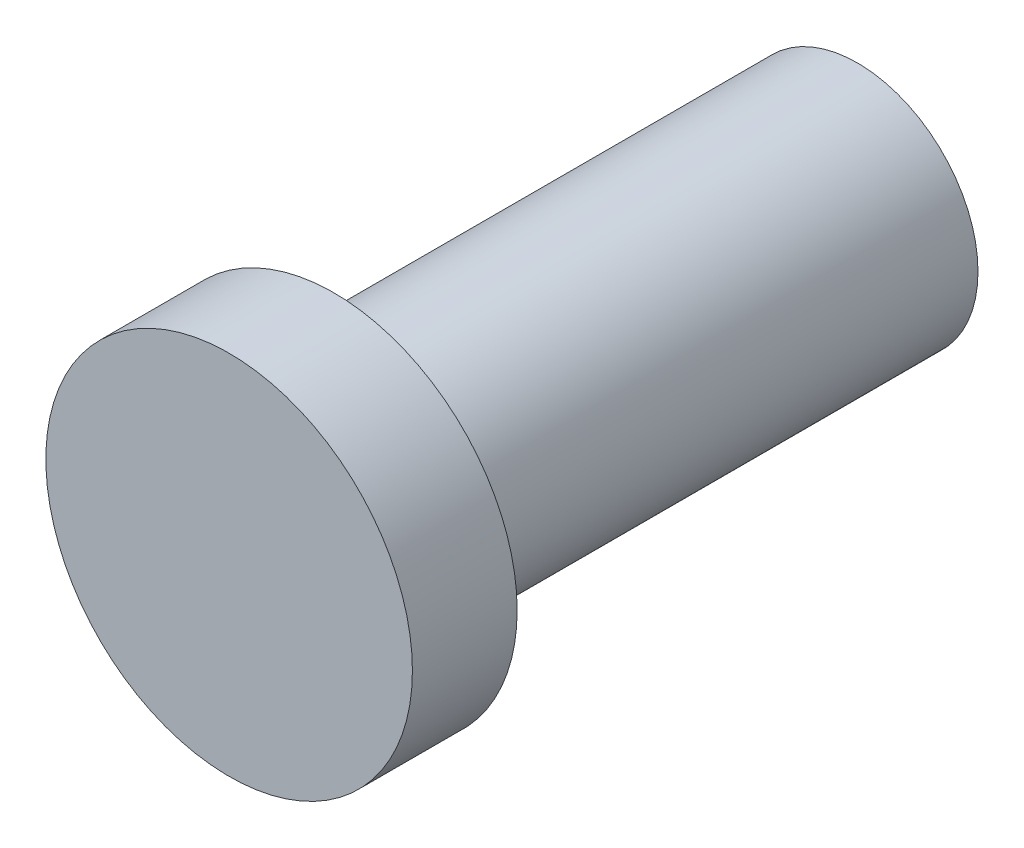
ISO-10303-21;
HEADER;
FILE_DESCRIPTION(('STEP AP214'),'2;1');
FILE_NAME('part.step','',(''),(''),'','','');
FILE_SCHEMA(('AUTOMOTIVE_DESIGN { 1 0 10303 214 1 1 1 1 }'));
ENDSEC;
DATA;
#1=APPLICATION_CONTEXT('core data for automotive mechanical design processes');
#2=APPLICATION_PROTOCOL_DEFINITION('international standard','automotive_design',2000,#1);
#3=PRODUCT_CONTEXT('',#1,'mechanical');
#4=PRODUCT('Part','Part','',(#3));
#5=PRODUCT_RELATED_PRODUCT_CATEGORY('part','',(#4));
#6=PRODUCT_DEFINITION_FORMATION('','',#4);
#7=PRODUCT_DEFINITION_CONTEXT('part definition',#1,'design');
#8=PRODUCT_DEFINITION('design','',#6,#7);
#9=PRODUCT_DEFINITION_SHAPE('','',#8);
#10=(LENGTH_UNIT() NAMED_UNIT(*) SI_UNIT(.MILLI.,.METRE.));
#11=(NAMED_UNIT(*) PLANE_ANGLE_UNIT() SI_UNIT($,.RADIAN.));
#12=(NAMED_UNIT(*) SI_UNIT($,.STERADIAN.) SOLID_ANGLE_UNIT());
#13=UNCERTAINTY_MEASURE_WITH_UNIT(LENGTH_MEASURE(1.E-05),#10,'distance_accuracy_value','');
#14=(GEOMETRIC_REPRESENTATION_CONTEXT(3) GLOBAL_UNCERTAINTY_ASSIGNED_CONTEXT((#13)) GLOBAL_UNIT_ASSIGNED_CONTEXT((#10,
#11,#12)) REPRESENTATION_CONTEXT('',''));
#15=CARTESIAN_POINT('',(0.,0.,0.));
#16=DIRECTION('',(0.,0.,1.));
#17=DIRECTION('',(1.,0.,0.));
#18=AXIS2_PLACEMENT_3D('',#15,#16,#17);
#19=CARTESIAN_POINT('',(0.,0.,5.));
#20=DIRECTION('',(0.,0.,-1.));
#21=DIRECTION('',(-1.,0.,0.));
#22=AXIS2_PLACEMENT_3D('',#19,#20,#21);
#23=CYLINDRICAL_SURFACE('',#22,1.15);
#24=CARTESIAN_POINT('',(0.,0.,5.));
#25=DIRECTION('',(0.,0.,1.));
#26=DIRECTION('',(1.,0.,0.));
#27=AXIS2_PLACEMENT_3D('',#24,#25,#26);
#28=CIRCLE('',#27,1.15);
#29=CARTESIAN_POINT('',(1.15,0.,5.));
#30=VERTEX_POINT('',#29);
#31=EDGE_CURVE('E10',#30,#30,#28,.T.);
#32=ORIENTED_EDGE('',*,*,#31,.F.);
#33=EDGE_LOOP('',(#32));
#34=FACE_BOUND('',#33,.T.);
#35=CARTESIAN_POINT('',(0.,0.,0.));
#36=DIRECTION('',(0.,0.,1.));
#37=DIRECTION('',(1.,0.,0.));
#38=AXIS2_PLACEMENT_3D('',#35,#36,#37);
#39=CIRCLE('',#38,1.15);
#40=CARTESIAN_POINT('',(1.15,0.,0.));
#41=VERTEX_POINT('',#40);
#42=EDGE_CURVE('E38',#41,#41,#39,.T.);
#43=ORIENTED_EDGE('',*,*,#42,.T.);
#44=EDGE_LOOP('',(#43));
#45=FACE_BOUND('',#44,.T.);
#46=ADVANCED_FACE('F35',(#34,#45),#23,.T.);
#47=CARTESIAN_POINT('',(0.,0.,0.));
#48=DIRECTION('',(0.,0.,1.));
#49=DIRECTION('',(1.,0.,0.));
#50=AXIS2_PLACEMENT_3D('',#47,#48,#49);
#51=PLANE('',#50);
#52=ORIENTED_EDGE('',*,*,#42,.F.);
#53=EDGE_LOOP('',(#52));
#54=FACE_BOUND('',#53,.T.);
#55=ADVANCED_FACE('F58',(#54),#51,.F.);
#56=CARTESIAN_POINT('',(0.,0.,6.));
#57=DIRECTION('',(0.,0.,-1.));
#58=DIRECTION('',(-1.,0.,0.));
#59=AXIS2_PLACEMENT_3D('',#56,#57,#58);
#60=CYLINDRICAL_SURFACE('',#59,1.75);
#61=CARTESIAN_POINT('',(0.,0.,6.));
#62=DIRECTION('',(0.,0.,1.));
#63=DIRECTION('',(1.,0.,0.));
#64=AXIS2_PLACEMENT_3D('',#61,#62,#63);
#65=CIRCLE('',#64,1.75);
#66=CARTESIAN_POINT('',(1.75,0.,6.));
#67=VERTEX_POINT('',#66);
#68=EDGE_CURVE('E45',#67,#67,#65,.T.);
#69=ORIENTED_EDGE('',*,*,#68,.F.);
#70=EDGE_LOOP('',(#69));
#71=FACE_BOUND('',#70,.T.);
#72=CARTESIAN_POINT('',(0.,0.,5.));
#73=DIRECTION('',(0.,0.,1.));
#74=DIRECTION('',(1.,0.,0.));
#75=AXIS2_PLACEMENT_3D('',#72,#73,#74);
#76=CIRCLE('',#75,1.75);
#77=CARTESIAN_POINT('',(1.75,0.,5.));
#78=VERTEX_POINT('',#77);
#79=EDGE_CURVE('E47',#78,#78,#76,.T.);
#80=ORIENTED_EDGE('',*,*,#79,.T.);
#81=EDGE_LOOP('',(#80));
#82=FACE_BOUND('',#81,.T.);
#83=ADVANCED_FACE('F55',(#71,#82),#60,.T.);
#84=CARTESIAN_POINT('',(0.,0.,6.));
#85=DIRECTION('',(0.,0.,1.));
#86=DIRECTION('',(1.,0.,0.));
#87=AXIS2_PLACEMENT_3D('',#84,#85,#86);
#88=PLANE('',#87);
#89=ORIENTED_EDGE('',*,*,#68,.T.);
#90=EDGE_LOOP('',(#89));
#91=FACE_BOUND('',#90,.T.);
#92=ADVANCED_FACE('F53',(#91),#88,.T.);
#93=CARTESIAN_POINT('',(0.,0.,5.));
#94=DIRECTION('',(0.,0.,1.));
#95=DIRECTION('',(1.,0.,0.));
#96=AXIS2_PLACEMENT_3D('',#93,#94,#95);
#97=PLANE('',#96);
#98=ORIENTED_EDGE('',*,*,#31,.T.);
#99=EDGE_LOOP('',(#98));
#100=FACE_BOUND('',#99,.T.);
#101=ORIENTED_EDGE('',*,*,#79,.F.);
#102=EDGE_LOOP('',(#101));
#103=FACE_BOUND('',#102,.T.);
#104=ADVANCED_FACE('F62',(#100,#103),#97,.F.);
#105=CLOSED_SHELL('',(#46,#55,#83,#92,#104));
#106=MANIFOLD_SOLID_BREP('B2',#105);
#107=ADVANCED_BREP_SHAPE_REPRESENTATION('',(#18,#106),#14);
#108=SHAPE_DEFINITION_REPRESENTATION(#9,#107);
ENDSEC;
END-ISO-10303-21;
